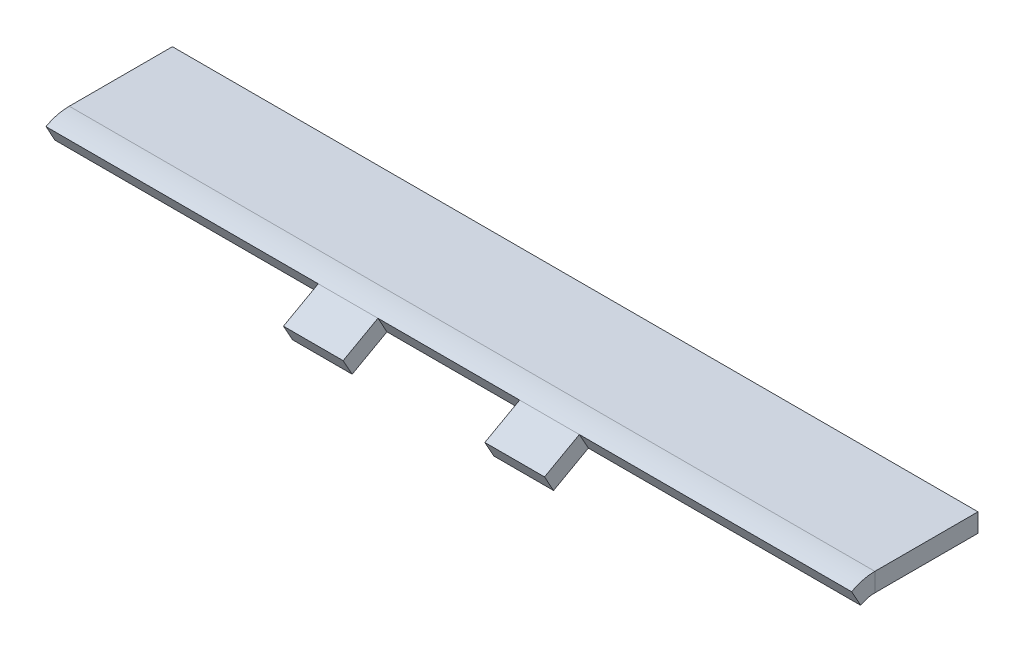
ISO-10303-21;
HEADER;
FILE_DESCRIPTION(('STEP AP214'),'2;1');
FILE_NAME('part.step','',(''),(''),'','','');
FILE_SCHEMA(('AUTOMOTIVE_DESIGN { 1 0 10303 214 1 1 1 1 }'));
ENDSEC;
DATA;
#1=APPLICATION_CONTEXT('core data for automotive mechanical design processes');
#2=APPLICATION_PROTOCOL_DEFINITION('international standard','automotive_design',2000,#1);
#3=PRODUCT_CONTEXT('',#1,'mechanical');
#4=PRODUCT('Part','Part','',(#3));
#5=PRODUCT_RELATED_PRODUCT_CATEGORY('part','',(#4));
#6=PRODUCT_DEFINITION_FORMATION('','',#4);
#7=PRODUCT_DEFINITION_CONTEXT('part definition',#1,'design');
#8=PRODUCT_DEFINITION('design','',#6,#7);
#9=PRODUCT_DEFINITION_SHAPE('','',#8);
#10=(LENGTH_UNIT() NAMED_UNIT(*) SI_UNIT(.MILLI.,.METRE.));
#11=(NAMED_UNIT(*) PLANE_ANGLE_UNIT() SI_UNIT($,.RADIAN.));
#12=(NAMED_UNIT(*) SI_UNIT($,.STERADIAN.) SOLID_ANGLE_UNIT());
#13=UNCERTAINTY_MEASURE_WITH_UNIT(LENGTH_MEASURE(1.E-05),#10,'distance_accuracy_value','');
#14=(GEOMETRIC_REPRESENTATION_CONTEXT(3) GLOBAL_UNCERTAINTY_ASSIGNED_CONTEXT((#13)) GLOBAL_UNIT_ASSIGNED_CONTEXT((#10,
#11,#12)) REPRESENTATION_CONTEXT('',''));
#15=CARTESIAN_POINT('',(0.,0.,0.));
#16=DIRECTION('',(0.,0.,1.));
#17=DIRECTION('',(1.,0.,0.));
#18=AXIS2_PLACEMENT_3D('',#15,#16,#17);
#19=CARTESIAN_POINT('',(0.,16.3240459615216,-4.04935847383113));
#20=DIRECTION('',(0.,0.874619707139399,0.484809620246332));
#21=DIRECTION('',(0.,-0.484809620246332,0.874619707139399));
#22=AXIS2_PLACEMENT_3D('',#19,#20,#21);
#23=PLANE('',#22);
#24=DIRECTION('',(-1.,0.,0.));
#25=VECTOR('',#24,1.);
#26=CARTESIAN_POINT('',(0.,4.30003221172907,17.6425365408352));
#27=LINE('',#26,#25);
#28=CARTESIAN_POINT('',(-24.13,4.30003221172911,17.6425365408352));
#29=VERTEX_POINT('',#28);
#30=CARTESIAN_POINT('',(-44.45,4.30003221172912,17.6425365408352));
#31=VERTEX_POINT('',#30);
#32=EDGE_CURVE('E198',#29,#31,#27,.T.);
#33=ORIENTED_EDGE('',*,*,#32,.T.);
#34=DIRECTION('',(0.,-0.484809620246332,0.874619707139399));
#35=VECTOR('',#34,1.);
#36=CARTESIAN_POINT('',(-44.45,16.3240459615216,-4.04935847383109));
#37=LINE('',#36,#35);
#38=CARTESIAN_POINT('',(-44.45,-2.26991504797987,29.4950351469649));
#39=VERTEX_POINT('',#38);
#40=EDGE_CURVE('E237',#31,#39,#37,.T.);
#41=ORIENTED_EDGE('',*,*,#40,.T.);
#42=DIRECTION('',(-1.,0.,0.));
#43=VECTOR('',#42,1.);
#44=CARTESIAN_POINT('',(-137.16,-2.26991504797988,29.4950351469649));
#45=LINE('',#44,#43);
#46=CARTESIAN_POINT('',(-24.13,-2.26991504797987,29.4950351469649));
#47=VERTEX_POINT('',#46);
#48=EDGE_CURVE('E184',#47,#39,#45,.T.);
#49=ORIENTED_EDGE('',*,*,#48,.F.);
#50=DIRECTION('',(0.,-0.484809620246332,0.874619707139399));
#51=VECTOR('',#50,1.);
#52=CARTESIAN_POINT('',(-24.13,16.3240459615216,-4.04935847383111));
#53=LINE('',#52,#51);
#54=EDGE_CURVE('E224',#29,#47,#53,.T.);
#55=ORIENTED_EDGE('',*,*,#54,.F.);
#56=EDGE_LOOP('',(#33,#41,#49,#55));
#57=FACE_BOUND('',#56,.T.);
#58=ADVANCED_FACE('F59',(#57),#23,.T.);
#59=CARTESIAN_POINT('',(44.45,4.30003221172911,17.6425365408352));
#60=VERTEX_POINT('',#59);
#61=CARTESIAN_POINT('',(24.13,4.30003221172911,17.6425365408352));
#62=VERTEX_POINT('',#61);
#63=EDGE_CURVE('E197',#60,#62,#27,.T.);
#64=ORIENTED_EDGE('',*,*,#63,.T.);
#65=DIRECTION('',(0.,-0.484809620246332,0.874619707139399));
#66=VECTOR('',#65,1.);
#67=CARTESIAN_POINT('',(24.13,16.3240459615216,-4.04935847383111));
#68=LINE('',#67,#66);
#69=CARTESIAN_POINT('',(24.13,-2.26991504797986,29.4950351469649));
#70=VERTEX_POINT('',#69);
#71=EDGE_CURVE('E221',#62,#70,#68,.T.);
#72=ORIENTED_EDGE('',*,*,#71,.T.);
#73=CARTESIAN_POINT('',(44.45,-2.26991504797986,29.4950351469649));
#74=VERTEX_POINT('',#73);
#75=EDGE_CURVE('E188',#74,#70,#45,.T.);
#76=ORIENTED_EDGE('',*,*,#75,.F.);
#77=DIRECTION('',(0.,-0.484809620246332,0.874619707139399));
#78=VECTOR('',#77,1.);
#79=CARTESIAN_POINT('',(44.45,16.3240459615216,-4.04935847383109));
#80=LINE('',#79,#78);
#81=EDGE_CURVE('E165',#60,#74,#80,.T.);
#82=ORIENTED_EDGE('',*,*,#81,.F.);
#83=EDGE_LOOP('',(#64,#72,#76,#82));
#84=FACE_BOUND('',#83,.T.);
#85=ADVANCED_FACE('F298',(#84),#23,.T.);
#86=CARTESIAN_POINT('',(0.,10.7702108211864,-7.12789956239533));
#87=DIRECTION('',(0.,0.874619707139399,0.484809620246332));
#88=DIRECTION('',(0.,-0.484809620246332,0.874619707139399));
#89=AXIS2_PLACEMENT_3D('',#86,#87,#88);
#90=PLANE('',#89);
#91=DIRECTION('',(0.,-0.484809620246332,0.874619707139399));
#92=VECTOR('',#91,1.);
#93=CARTESIAN_POINT('',(-44.45,10.7702108211864,-7.12789956239529));
#94=LINE('',#93,#92);
#95=CARTESIAN_POINT('',(-44.45,-1.25380292860607,14.563995452271));
#96=VERTEX_POINT('',#95);
#97=CARTESIAN_POINT('',(-44.45,-7.82375018831504,26.4164940584007));
#98=VERTEX_POINT('',#97);
#99=EDGE_CURVE('E235',#96,#98,#94,.T.);
#100=ORIENTED_EDGE('',*,*,#99,.F.);
#101=DIRECTION('',(-1.,0.,0.));
#102=VECTOR('',#101,1.);
#103=CARTESIAN_POINT('',(137.16,-1.25380292860611,14.5639954522709));
#104=LINE('',#103,#102);
#105=CARTESIAN_POINT('',(-24.13,-1.25380292860611,14.5639954522709));
#106=VERTEX_POINT('',#105);
#107=EDGE_CURVE('E204',#106,#96,#104,.T.);
#108=ORIENTED_EDGE('',*,*,#107,.F.);
#109=DIRECTION('',(0.,-0.484809620246332,0.874619707139399));
#110=VECTOR('',#109,1.);
#111=CARTESIAN_POINT('',(-24.13,10.7702108211864,-7.12789956239531));
#112=LINE('',#111,#110);
#113=CARTESIAN_POINT('',(-24.13,-7.82375018831504,26.4164940584007));
#114=VERTEX_POINT('',#113);
#115=EDGE_CURVE('E228',#106,#114,#112,.T.);
#116=ORIENTED_EDGE('',*,*,#115,.T.);
#117=DIRECTION('',(1.,0.,0.));
#118=VECTOR('',#117,1.);
#119=CARTESIAN_POINT('',(0.,-7.82375018831506,26.4164940584007));
#120=LINE('',#119,#118);
#121=EDGE_CURVE('E185',#114,#98,#120,.F.);
#122=ORIENTED_EDGE('',*,*,#121,.T.);
#123=EDGE_LOOP('',(#100,#108,#116,#122));
#124=FACE_BOUND('',#123,.T.);
#125=ADVANCED_FACE('F321',(#124),#90,.F.);
#126=DIRECTION('',(0.,-0.484809620246332,0.874619707139399));
#127=VECTOR('',#126,1.);
#128=CARTESIAN_POINT('',(24.13,10.7702108211864,-7.12789956239531));
#129=LINE('',#128,#127);
#130=CARTESIAN_POINT('',(24.13,-1.25380292860607,14.563995452271));
#131=VERTEX_POINT('',#130);
#132=CARTESIAN_POINT('',(24.13,-7.82375018831504,26.4164940584007));
#133=VERTEX_POINT('',#132);
#134=EDGE_CURVE('E219',#131,#133,#129,.T.);
#135=ORIENTED_EDGE('',*,*,#134,.F.);
#136=CARTESIAN_POINT('',(44.45,-1.25380292860611,14.5639954522709));
#137=VERTEX_POINT('',#136);
#138=EDGE_CURVE('E177',#137,#131,#104,.T.);
#139=ORIENTED_EDGE('',*,*,#138,.F.);
#140=DIRECTION('',(0.,-0.484809620246332,0.874619707139399));
#141=VECTOR('',#140,1.);
#142=CARTESIAN_POINT('',(44.45,10.7702108211864,-7.12789956239529));
#143=LINE('',#142,#141);
#144=CARTESIAN_POINT('',(44.45,-7.82375018831504,26.4164940584007));
#145=VERTEX_POINT('',#144);
#146=EDGE_CURVE('E162',#137,#145,#143,.T.);
#147=ORIENTED_EDGE('',*,*,#146,.T.);
#148=EDGE_CURVE('E175',#145,#133,#120,.F.);
#149=ORIENTED_EDGE('',*,*,#148,.T.);
#150=EDGE_LOOP('',(#135,#139,#147,#149));
#151=FACE_BOUND('',#150,.T.);
#152=ADVANCED_FACE('F174',(#151),#90,.F.);
#153=CARTESIAN_POINT('',(-137.16,-2.26991504797988,29.4950351469649));
#154=DIRECTION('',(0.,-0.484809620246332,0.874619707139399));
#155=DIRECTION('',(0.,-0.874619707139399,-0.484809620246332));
#156=AXIS2_PLACEMENT_3D('',#153,#154,#155);
#157=PLANE('',#156);
#158=ORIENTED_EDGE('',*,*,#48,.T.);
#159=DIRECTION('',(0.,0.874619707139399,0.484809620246332));
#160=VECTOR('',#159,1.);
#161=CARTESIAN_POINT('',(-44.45,-29.7951897561786,14.2375262324866));
#162=LINE('',#161,#160);
#163=EDGE_CURVE('E179',#98,#39,#162,.T.);
#164=ORIENTED_EDGE('',*,*,#163,.F.);
#165=ORIENTED_EDGE('',*,*,#121,.F.);
#166=DIRECTION('',(0.,0.874619707139399,0.484809620246332));
#167=VECTOR('',#166,1.);
#168=CARTESIAN_POINT('',(-24.13,-29.7951897561786,14.2375262324866));
#169=LINE('',#168,#167);
#170=EDGE_CURVE('E304',#114,#47,#169,.T.);
#171=ORIENTED_EDGE('',*,*,#170,.T.);
#172=EDGE_LOOP('',(#158,#164,#165,#171));
#173=FACE_BOUND('',#172,.T.);
#174=ADVANCED_FACE('F61',(#173),#157,.T.);
#175=ORIENTED_EDGE('',*,*,#75,.T.);
#176=DIRECTION('',(0.,0.874619707139399,0.484809620246332));
#177=VECTOR('',#176,1.);
#178=CARTESIAN_POINT('',(24.13,-29.7951897561786,14.2375262324866));
#179=LINE('',#178,#177);
#180=EDGE_CURVE('E183',#133,#70,#179,.T.);
#181=ORIENTED_EDGE('',*,*,#180,.F.);
#182=ORIENTED_EDGE('',*,*,#148,.F.);
#183=DIRECTION('',(0.,0.874619707139399,0.484809620246332));
#184=VECTOR('',#183,1.);
#185=CARTESIAN_POINT('',(44.45,-29.7951897561786,14.2375262324866));
#186=LINE('',#185,#184);
#187=EDGE_CURVE('E159',#145,#74,#186,.T.);
#188=ORIENTED_EDGE('',*,*,#187,.T.);
#189=EDGE_LOOP('',(#175,#181,#182,#188));
#190=FACE_BOUND('',#189,.T.);
#191=ADVANCED_FACE('F182',(#190),#157,.T.);
#192=CARTESIAN_POINT('',(-137.16,6.35,-25.4));
#193=DIRECTION('',(0.,0.,-1.));
#194=DIRECTION('',(-1.,0.,0.));
#195=AXIS2_PLACEMENT_3D('',#192,#193,#194);
#196=PLANE('',#195);
#197=DIRECTION('',(1.,0.,0.));
#198=VECTOR('',#197,1.);
#199=CARTESIAN_POINT('',(0.,0.,-25.4));
#200=LINE('',#199,#198);
#201=CARTESIAN_POINT('',(137.16,0.,-25.4));
#202=VERTEX_POINT('',#201);
#203=CARTESIAN_POINT('',(-137.16,0.,-25.4));
#204=VERTEX_POINT('',#203);
#205=EDGE_CURVE('E272',#202,#204,#200,.F.);
#206=ORIENTED_EDGE('',*,*,#205,.T.);
#207=DIRECTION('',(0.,1.,0.));
#208=VECTOR('',#207,1.);
#209=CARTESIAN_POINT('',(-137.16,6.35,-25.4));
#210=LINE('',#209,#208);
#211=CARTESIAN_POINT('',(-137.16,6.35,-25.4));
#212=VERTEX_POINT('',#211);
#213=EDGE_CURVE('E270',#204,#212,#210,.T.);
#214=ORIENTED_EDGE('',*,*,#213,.T.);
#215=DIRECTION('',(-1.,0.,0.));
#216=VECTOR('',#215,1.);
#217=CARTESIAN_POINT('',(-137.16,6.35,-25.4));
#218=LINE('',#217,#216);
#219=CARTESIAN_POINT('',(137.16,6.35,-25.4));
#220=VERTEX_POINT('',#219);
#221=EDGE_CURVE('E261',#220,#212,#218,.T.);
#222=ORIENTED_EDGE('',*,*,#221,.F.);
#223=DIRECTION('',(0.,1.,0.));
#224=VECTOR('',#223,1.);
#225=CARTESIAN_POINT('',(137.16,6.35,-25.4));
#226=LINE('',#225,#224);
#227=EDGE_CURVE('E256',#202,#220,#226,.T.);
#228=ORIENTED_EDGE('',*,*,#227,.F.);
#229=EDGE_LOOP('',(#206,#214,#222,#228));
#230=FACE_BOUND('',#229,.T.);
#231=ADVANCED_FACE('F346',(#230),#196,.T.);
#232=CARTESIAN_POINT('',(0.,6.35,0.));
#233=DIRECTION('',(0.,1.,0.));
#234=DIRECTION('',(0.,0.,1.));
#235=AXIS2_PLACEMENT_3D('',#232,#233,#234);
#236=PLANE('',#235);
#237=DIRECTION('',(0.,0.,1.));
#238=VECTOR('',#237,1.);
#239=CARTESIAN_POINT('',(-137.16,6.35,-25.4));
#240=LINE('',#239,#238);
#241=CARTESIAN_POINT('',(-137.16,6.35,9.71589924980754));
#242=VERTEX_POINT('',#241);
#243=EDGE_CURVE('E268',#212,#242,#240,.T.);
#244=ORIENTED_EDGE('',*,*,#243,.T.);
#245=DIRECTION('',(1.,0.,0.));
#246=VECTOR('',#245,1.);
#247=CARTESIAN_POINT('',(-137.16,6.35,9.71589924980754));
#248=LINE('',#247,#246);
#249=CARTESIAN_POINT('',(137.16,6.35,9.71589924980755));
#250=VERTEX_POINT('',#249);
#251=EDGE_CURVE('E266',#242,#250,#248,.T.);
#252=ORIENTED_EDGE('',*,*,#251,.T.);
#253=DIRECTION('',(0.,0.,-1.));
#254=VECTOR('',#253,1.);
#255=CARTESIAN_POINT('',(137.16,6.35,-25.4));
#256=LINE('',#255,#254);
#257=EDGE_CURVE('E264',#250,#220,#256,.T.);
#258=ORIENTED_EDGE('',*,*,#257,.T.);
#259=ORIENTED_EDGE('',*,*,#221,.T.);
#260=EDGE_LOOP('',(#244,#252,#258,#259));
#261=FACE_BOUND('',#260,.T.);
#262=ADVANCED_FACE('F342',(#261),#236,.T.);
#263=CARTESIAN_POINT('',(137.16,6.35,-25.4));
#264=DIRECTION('',(1.,0.,0.));
#265=DIRECTION('',(0.,0.,-1.));
#266=AXIS2_PLACEMENT_3D('',#263,#264,#265);
#267=PLANE('',#266);
#268=DIRECTION('',(0.,1.,0.));
#269=VECTOR('',#268,1.);
#270=CARTESIAN_POINT('',(137.16,0.,9.71589924980755));
#271=LINE('',#270,#269);
#272=CARTESIAN_POINT('',(137.16,0.,9.71589924980755));
#273=VERTEX_POINT('',#272);
#274=EDGE_CURVE('E275',#273,#250,#271,.T.);
#275=ORIENTED_EDGE('',*,*,#274,.F.);
#276=DIRECTION('',(0.,0.,1.));
#277=VECTOR('',#276,1.);
#278=CARTESIAN_POINT('',(137.16,0.,0.));
#279=LINE('',#278,#277);
#280=EDGE_CURVE('E259',#273,#202,#279,.F.);
#281=ORIENTED_EDGE('',*,*,#280,.T.);
#282=ORIENTED_EDGE('',*,*,#227,.T.);
#283=ORIENTED_EDGE('',*,*,#257,.F.);
#284=EDGE_LOOP('',(#275,#281,#282,#283));
#285=FACE_BOUND('',#284,.T.);
#286=ADVANCED_FACE('F339',(#285),#267,.T.);
#287=CARTESIAN_POINT('',(0.,0.,0.));
#288=DIRECTION('',(0.,1.,0.));
#289=DIRECTION('',(0.,0.,1.));
#290=AXIS2_PLACEMENT_3D('',#287,#288,#289);
#291=PLANE('',#290);
#292=DIRECTION('',(1.,0.,0.));
#293=VECTOR('',#292,1.);
#294=CARTESIAN_POINT('',(-137.16,0.,9.71589924980755));
#295=LINE('',#294,#293);
#296=CARTESIAN_POINT('',(-137.16,0.,9.71589924980755));
#297=VERTEX_POINT('',#296);
#298=EDGE_CURVE('E248',#297,#273,#295,.T.);
#299=ORIENTED_EDGE('',*,*,#298,.F.);
#300=DIRECTION('',(0.,0.,1.));
#301=VECTOR('',#300,1.);
#302=CARTESIAN_POINT('',(-137.16,0.,0.));
#303=LINE('',#302,#301);
#304=EDGE_CURVE('E254',#204,#297,#303,.T.);
#305=ORIENTED_EDGE('',*,*,#304,.F.);
#306=ORIENTED_EDGE('',*,*,#205,.F.);
#307=ORIENTED_EDGE('',*,*,#280,.F.);
#308=EDGE_LOOP('',(#299,#305,#306,#307));
#309=FACE_BOUND('',#308,.T.);
#310=ADVANCED_FACE('F335',(#309),#291,.F.);
#311=CARTESIAN_POINT('',(-137.16,6.35,-25.4));
#312=DIRECTION('',(-1.,0.,0.));
#313=DIRECTION('',(0.,0.,1.));
#314=AXIS2_PLACEMENT_3D('',#311,#312,#313);
#315=PLANE('',#314);
#316=ORIENTED_EDGE('',*,*,#304,.T.);
#317=DIRECTION('',(0.,1.,0.));
#318=VECTOR('',#317,1.);
#319=CARTESIAN_POINT('',(-137.16,0.,9.71589924980755));
#320=LINE('',#319,#318);
#321=EDGE_CURVE('E191',#297,#242,#320,.T.);
#322=ORIENTED_EDGE('',*,*,#321,.T.);
#323=ORIENTED_EDGE('',*,*,#243,.F.);
#324=ORIENTED_EDGE('',*,*,#213,.F.);
#325=EDGE_LOOP('',(#316,#322,#323,#324));
#326=FACE_BOUND('',#325,.T.);
#327=ADVANCED_FACE('F332',(#326),#315,.T.);
#328=CARTESIAN_POINT('',(137.16,-10.,9.71589924980754));
#329=DIRECTION('',(1.,0.,0.));
#330=DIRECTION('',(0.,0.,-1.));
#331=AXIS2_PLACEMENT_3D('',#328,#329,#330);
#332=PLANE('',#331);
#333=DIRECTION('',(0.,0.874619707139399,0.484809620246332));
#334=VECTOR('',#333,1.);
#335=CARTESIAN_POINT('',(137.16,4.30003221172907,17.6425365408352));
#336=LINE('',#335,#334);
#337=CARTESIAN_POINT('',(137.16,-1.25380292860607,14.563995452271));
#338=VERTEX_POINT('',#337);
#339=CARTESIAN_POINT('',(137.16,4.30003221172911,17.6425365408352));
#340=VERTEX_POINT('',#339);
#341=EDGE_CURVE('E196',#338,#340,#336,.T.);
#342=ORIENTED_EDGE('',*,*,#341,.F.);
#343=CARTESIAN_POINT('',(137.16,-10.,9.71589924980754));
#344=DIRECTION('',(1.,0.,0.));
#345=DIRECTION('',(0.,0.,-1.));
#346=AXIS2_PLACEMENT_3D('',#343,#344,#345);
#347=CIRCLE('',#346,10.);
#348=EDGE_CURVE('E240',#338,#273,#347,.F.);
#349=ORIENTED_EDGE('',*,*,#348,.T.);
#350=ORIENTED_EDGE('',*,*,#274,.T.);
#351=CARTESIAN_POINT('',(137.16,-10.,9.71589924980754));
#352=DIRECTION('',(-1.,0.,0.));
#353=DIRECTION('',(0.,0.,1.));
#354=AXIS2_PLACEMENT_3D('',#351,#352,#353);
#355=CIRCLE('',#354,16.35);
#356=EDGE_CURVE('E241',#340,#250,#355,.T.);
#357=ORIENTED_EDGE('',*,*,#356,.F.);
#358=EDGE_LOOP('',(#342,#349,#350,#357));
#359=FACE_BOUND('',#358,.T.);
#360=ADVANCED_FACE('F283',(#359),#332,.T.);
#361=CARTESIAN_POINT('',(-137.16,-10.,9.71589924980754));
#362=DIRECTION('',(-1.,0.,0.));
#363=DIRECTION('',(0.,0.,1.));
#364=AXIS2_PLACEMENT_3D('',#361,#362,#363);
#365=PLANE('',#364);
#366=CARTESIAN_POINT('',(-137.16,-10.,9.71589924980754));
#367=DIRECTION('',(1.,0.,0.));
#368=DIRECTION('',(0.,0.,-1.));
#369=AXIS2_PLACEMENT_3D('',#366,#367,#368);
#370=CIRCLE('',#369,10.);
#371=CARTESIAN_POINT('',(-137.16,-1.25380292860603,14.5639954522709));
#372=VERTEX_POINT('',#371);
#373=EDGE_CURVE('E245',#297,#372,#370,.T.);
#374=ORIENTED_EDGE('',*,*,#373,.T.);
#375=DIRECTION('',(0.,0.874619707139399,0.484809620246332));
#376=VECTOR('',#375,1.);
#377=CARTESIAN_POINT('',(-137.16,-1.25380292860611,14.5639954522709));
#378=LINE('',#377,#376);
#379=CARTESIAN_POINT('',(-137.16,4.30003221172911,17.6425365408352));
#380=VERTEX_POINT('',#379);
#381=EDGE_CURVE('E13',#372,#380,#378,.T.);
#382=ORIENTED_EDGE('',*,*,#381,.T.);
#383=CARTESIAN_POINT('',(-137.16,-10.,9.71589924980754));
#384=DIRECTION('',(1.,0.,0.));
#385=DIRECTION('',(0.,0.,-1.));
#386=AXIS2_PLACEMENT_3D('',#383,#384,#385);
#387=CIRCLE('',#386,16.35);
#388=EDGE_CURVE('E244',#242,#380,#387,.T.);
#389=ORIENTED_EDGE('',*,*,#388,.F.);
#390=ORIENTED_EDGE('',*,*,#321,.F.);
#391=EDGE_LOOP('',(#374,#382,#389,#390));
#392=FACE_BOUND('',#391,.T.);
#393=ADVANCED_FACE('F351',(#392),#365,.T.);
#394=CARTESIAN_POINT('',(-274.474504004756,-10.,9.71589924980754));
#395=DIRECTION('',(1.,0.,0.));
#396=DIRECTION('',(0.,0.,-1.));
#397=AXIS2_PLACEMENT_3D('',#394,#395,#396);
#398=CYLINDRICAL_SURFACE('',#397,16.35);
#399=ORIENTED_EDGE('',*,*,#251,.F.);
#400=ORIENTED_EDGE('',*,*,#388,.T.);
#401=DIRECTION('',(1.,0.,0.));
#402=VECTOR('',#401,1.);
#403=CARTESIAN_POINT('',(-274.474504004756,4.30003221172911,17.6425365408352));
#404=LINE('',#403,#402);
#405=EDGE_CURVE('E233',#31,#380,#404,.F.);
#406=ORIENTED_EDGE('',*,*,#405,.F.);
#407=ORIENTED_EDGE('',*,*,#32,.F.);
#408=DIRECTION('',(1.,0.,0.));
#409=VECTOR('',#408,1.);
#410=CARTESIAN_POINT('',(-274.474504004756,4.30003221172911,17.6425365408352));
#411=LINE('',#410,#409);
#412=EDGE_CURVE('E226',#62,#29,#411,.F.);
#413=ORIENTED_EDGE('',*,*,#412,.F.);
#414=ORIENTED_EDGE('',*,*,#63,.F.);
#415=EDGE_CURVE('E194',#340,#60,#27,.T.);
#416=ORIENTED_EDGE('',*,*,#415,.F.);
#417=ORIENTED_EDGE('',*,*,#356,.T.);
#418=EDGE_LOOP('',(#399,#400,#406,#407,#413,#414,#416,#417));
#419=FACE_BOUND('',#418,.T.);
#420=ADVANCED_FACE('F291',(#419),#398,.T.);
#421=CARTESIAN_POINT('',(-274.474504004756,-10.,9.71589924980754));
#422=DIRECTION('',(1.,0.,0.));
#423=DIRECTION('',(0.,0.,-1.));
#424=AXIS2_PLACEMENT_3D('',#421,#422,#423);
#425=CYLINDRICAL_SURFACE('',#424,10.);
#426=ORIENTED_EDGE('',*,*,#298,.T.);
#427=ORIENTED_EDGE('',*,*,#348,.F.);
#428=EDGE_CURVE('E67',#338,#137,#104,.T.);
#429=ORIENTED_EDGE('',*,*,#428,.T.);
#430=ORIENTED_EDGE('',*,*,#138,.T.);
#431=EDGE_CURVE('E202',#131,#106,#104,.T.);
#432=ORIENTED_EDGE('',*,*,#431,.T.);
#433=ORIENTED_EDGE('',*,*,#107,.T.);
#434=EDGE_CURVE('E199',#96,#372,#104,.T.);
#435=ORIENTED_EDGE('',*,*,#434,.T.);
#436=ORIENTED_EDGE('',*,*,#373,.F.);
#437=EDGE_LOOP('',(#426,#427,#429,#430,#432,#433,#435,#436));
#438=FACE_BOUND('',#437,.T.);
#439=ADVANCED_FACE('F211',(#438),#425,.F.);
#440=CARTESIAN_POINT('',(0.,-23.2252424964697,2.38502762635683));
#441=DIRECTION('',(0.,0.484809620246332,-0.874619707139399));
#442=DIRECTION('',(0.,0.874619707139399,0.484809620246332));
#443=AXIS2_PLACEMENT_3D('',#440,#441,#442);
#444=PLANE('',#443);
#445=ORIENTED_EDGE('',*,*,#415,.T.);
#446=DIRECTION('',(0.,0.874619707139399,0.484809620246332));
#447=VECTOR('',#446,1.);
#448=CARTESIAN_POINT('',(44.45,-23.2252424964697,2.38502762635683));
#449=LINE('',#448,#447);
#450=EDGE_CURVE('E82',#137,#60,#449,.T.);
#451=ORIENTED_EDGE('',*,*,#450,.F.);
#452=ORIENTED_EDGE('',*,*,#428,.F.);
#453=ORIENTED_EDGE('',*,*,#341,.T.);
#454=EDGE_LOOP('',(#445,#451,#452,#453));
#455=FACE_BOUND('',#454,.T.);
#456=ADVANCED_FACE('F287',(#455),#444,.F.);
#457=CARTESIAN_POINT('',(44.45,-16.7550638870123,-9.28748357024014));
#458=DIRECTION('',(-1.,0.,0.));
#459=DIRECTION('',(0.,0.,1.));
#460=AXIS2_PLACEMENT_3D('',#457,#458,#459);
#461=PLANE('',#460);
#462=ORIENTED_EDGE('',*,*,#81,.T.);
#463=ORIENTED_EDGE('',*,*,#187,.F.);
#464=ORIENTED_EDGE('',*,*,#146,.F.);
#465=ORIENTED_EDGE('',*,*,#450,.T.);
#466=EDGE_LOOP('',(#462,#463,#464,#465));
#467=FACE_BOUND('',#466,.T.);
#468=ADVANCED_FACE('F161',(#467),#461,.F.);
#469=CARTESIAN_POINT('',(0.,-23.2252424964697,2.38502762635683));
#470=DIRECTION('',(0.,0.484809620246332,-0.874619707139399));
#471=DIRECTION('',(0.,0.874619707139399,0.484809620246332));
#472=AXIS2_PLACEMENT_3D('',#469,#470,#471);
#473=PLANE('',#472);
#474=ORIENTED_EDGE('',*,*,#412,.T.);
#475=DIRECTION('',(0.,0.874619707139399,0.484809620246332));
#476=VECTOR('',#475,1.);
#477=CARTESIAN_POINT('',(-24.13,-23.2252424964697,2.38502762635683));
#478=LINE('',#477,#476);
#479=EDGE_CURVE('E74',#106,#29,#478,.T.);
#480=ORIENTED_EDGE('',*,*,#479,.F.);
#481=ORIENTED_EDGE('',*,*,#431,.F.);
#482=DIRECTION('',(0.,0.874619707139399,0.484809620246332));
#483=VECTOR('',#482,1.);
#484=CARTESIAN_POINT('',(24.13,-23.2252424964697,2.38502762635683));
#485=LINE('',#484,#483);
#486=EDGE_CURVE('E215',#131,#62,#485,.T.);
#487=ORIENTED_EDGE('',*,*,#486,.T.);
#488=EDGE_LOOP('',(#474,#480,#481,#487));
#489=FACE_BOUND('',#488,.T.);
#490=ADVANCED_FACE('F214',(#489),#473,.F.);
#491=CARTESIAN_POINT('',(24.13,-16.7550638870123,-9.28748357024016));
#492=DIRECTION('',(-1.,0.,0.));
#493=DIRECTION('',(0.,0.,1.));
#494=AXIS2_PLACEMENT_3D('',#491,#492,#493);
#495=PLANE('',#494);
#496=ORIENTED_EDGE('',*,*,#486,.F.);
#497=ORIENTED_EDGE('',*,*,#134,.T.);
#498=ORIENTED_EDGE('',*,*,#180,.T.);
#499=ORIENTED_EDGE('',*,*,#71,.F.);
#500=EDGE_LOOP('',(#496,#497,#498,#499));
#501=FACE_BOUND('',#500,.T.);
#502=ADVANCED_FACE('F218',(#501),#495,.T.);
#503=CARTESIAN_POINT('',(-24.13,-16.7550638870123,-9.28748357024016));
#504=DIRECTION('',(-1.,0.,0.));
#505=DIRECTION('',(0.,0.,1.));
#506=AXIS2_PLACEMENT_3D('',#503,#504,#505);
#507=PLANE('',#506);
#508=ORIENTED_EDGE('',*,*,#54,.T.);
#509=ORIENTED_EDGE('',*,*,#170,.F.);
#510=ORIENTED_EDGE('',*,*,#115,.F.);
#511=ORIENTED_EDGE('',*,*,#479,.T.);
#512=EDGE_LOOP('',(#508,#509,#510,#511));
#513=FACE_BOUND('',#512,.T.);
#514=ADVANCED_FACE('F319',(#513),#507,.F.);
#515=CARTESIAN_POINT('',(-44.45,-16.7550638870123,-9.28748357024014));
#516=DIRECTION('',(-1.,0.,0.));
#517=DIRECTION('',(0.,0.,1.));
#518=AXIS2_PLACEMENT_3D('',#515,#516,#517);
#519=PLANE('',#518);
#520=DIRECTION('',(0.,0.874619707139399,0.484809620246332));
#521=VECTOR('',#520,1.);
#522=CARTESIAN_POINT('',(-44.45,-23.2252424964697,2.38502762635683));
#523=LINE('',#522,#521);
#524=EDGE_CURVE('E222',#96,#31,#523,.T.);
#525=ORIENTED_EDGE('',*,*,#524,.F.);
#526=ORIENTED_EDGE('',*,*,#99,.T.);
#527=ORIENTED_EDGE('',*,*,#163,.T.);
#528=ORIENTED_EDGE('',*,*,#40,.F.);
#529=EDGE_LOOP('',(#525,#526,#527,#528));
#530=FACE_BOUND('',#529,.T.);
#531=ADVANCED_FACE('F313',(#530),#519,.T.);
#532=CARTESIAN_POINT('',(0.,-23.2252424964697,2.38502762635683));
#533=DIRECTION('',(0.,0.484809620246332,-0.874619707139399));
#534=DIRECTION('',(0.,0.874619707139399,0.484809620246332));
#535=AXIS2_PLACEMENT_3D('',#532,#533,#534);
#536=PLANE('',#535);
#537=ORIENTED_EDGE('',*,*,#405,.T.);
#538=ORIENTED_EDGE('',*,*,#381,.F.);
#539=ORIENTED_EDGE('',*,*,#434,.F.);
#540=ORIENTED_EDGE('',*,*,#524,.T.);
#541=EDGE_LOOP('',(#537,#538,#539,#540));
#542=FACE_BOUND('',#541,.T.);
#543=ADVANCED_FACE('F373',(#542),#536,.F.);
#544=CLOSED_SHELL('',(#58,#85,#125,#152,#174,#191,#231,#262,#286,#310,#327,#360,#393,#420,#439,
#456,#468,#490,#502,#514,#531,#543));
#545=MANIFOLD_SOLID_BREP('B2',#544);
#546=ADVANCED_BREP_SHAPE_REPRESENTATION('',(#18,#545),#14);
#547=SHAPE_DEFINITION_REPRESENTATION(#9,#546);
ENDSEC;
END-ISO-10303-21;
